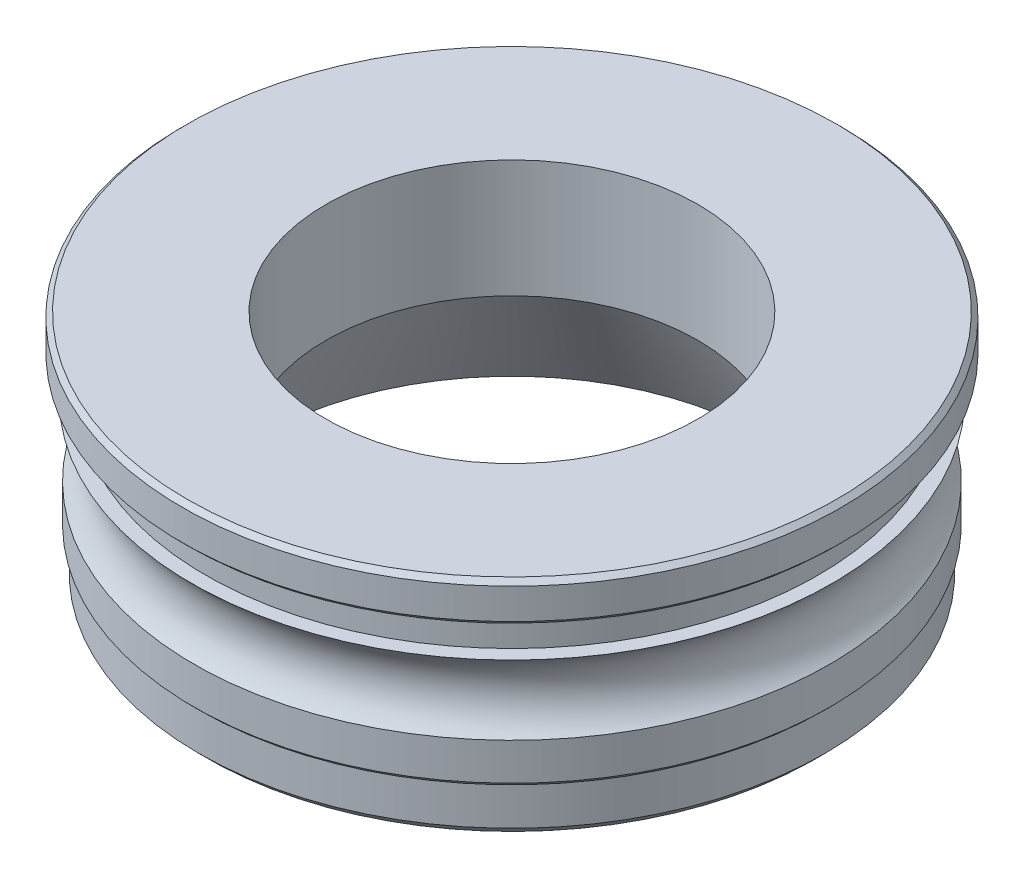
ISO-10303-21;
HEADER;
FILE_DESCRIPTION(('STEP AP214'),'2;1');
FILE_NAME('part.step','',(''),(''),'','','');
FILE_SCHEMA(('AUTOMOTIVE_DESIGN { 1 0 10303 214 1 1 1 1 }'));
ENDSEC;
DATA;
#1=APPLICATION_CONTEXT('core data for automotive mechanical design processes');
#2=APPLICATION_PROTOCOL_DEFINITION('international standard','automotive_design',2000,#1);
#3=PRODUCT_CONTEXT('',#1,'mechanical');
#4=PRODUCT('Part','Part','',(#3));
#5=PRODUCT_RELATED_PRODUCT_CATEGORY('part','',(#4));
#6=PRODUCT_DEFINITION_FORMATION('','',#4);
#7=PRODUCT_DEFINITION_CONTEXT('part definition',#1,'design');
#8=PRODUCT_DEFINITION('design','',#6,#7);
#9=PRODUCT_DEFINITION_SHAPE('','',#8);
#10=(LENGTH_UNIT() NAMED_UNIT(*) SI_UNIT(.MILLI.,.METRE.));
#11=(NAMED_UNIT(*) PLANE_ANGLE_UNIT() SI_UNIT($,.RADIAN.));
#12=(NAMED_UNIT(*) SI_UNIT($,.STERADIAN.) SOLID_ANGLE_UNIT());
#13=UNCERTAINTY_MEASURE_WITH_UNIT(LENGTH_MEASURE(1.E-05),#10,'distance_accuracy_value','');
#14=(GEOMETRIC_REPRESENTATION_CONTEXT(3) GLOBAL_UNCERTAINTY_ASSIGNED_CONTEXT((#13)) GLOBAL_UNIT_ASSIGNED_CONTEXT((#10,
#11,#12)) REPRESENTATION_CONTEXT('',''));
#15=CARTESIAN_POINT('',(0.,0.,0.));
#16=DIRECTION('',(0.,0.,1.));
#17=DIRECTION('',(1.,0.,0.));
#18=AXIS2_PLACEMENT_3D('',#15,#16,#17);
#19=CARTESIAN_POINT('',(5.39337567297407,0.,0.));
#20=DIRECTION('',(0.,-1.,0.));
#21=DIRECTION('',(0.,0.,-1.));
#22=AXIS2_PLACEMENT_3D('',#19,#20,#21);
#23=PLANE('',#22);
#24=CARTESIAN_POINT('',(0.,0.,0.));
#25=DIRECTION('',(0.,-1.,0.));
#26=DIRECTION('',(0.,0.,-1.));
#27=AXIS2_PLACEMENT_3D('',#24,#25,#26);
#28=CIRCLE('',#27,6.45);
#29=CARTESIAN_POINT('',(0.,0.,-6.45));
#30=VERTEX_POINT('',#29);
#31=EDGE_CURVE('E79',#30,#30,#28,.T.);
#32=ORIENTED_EDGE('',*,*,#31,.T.);
#33=EDGE_LOOP('',(#32));
#34=FACE_BOUND('',#33,.T.);
#35=CARTESIAN_POINT('',(0.,0.,0.));
#36=DIRECTION('',(0.,-1.,0.));
#37=DIRECTION('',(0.,0.,-1.));
#38=AXIS2_PLACEMENT_3D('',#35,#36,#37);
#39=CIRCLE('',#38,5.39337567297407);
#40=CARTESIAN_POINT('',(0.,0.,-5.39337567297407));
#41=VERTEX_POINT('',#40);
#42=EDGE_CURVE('E10',#41,#41,#39,.T.);
#43=ORIENTED_EDGE('',*,*,#42,.F.);
#44=EDGE_LOOP('',(#43));
#45=FACE_BOUND('',#44,.T.);
#46=ADVANCED_FACE('F30',(#34,#45),#23,.T.);
#47=CARTESIAN_POINT('',(0.,2.5,0.));
#48=DIRECTION('',(0.,-1.,0.));
#49=DIRECTION('',(0.,0.,-1.));
#50=AXIS2_PLACEMENT_3D('',#47,#48,#49);
#51=CONICAL_SURFACE('',#50,3.95,0.523598775598301);
#52=ORIENTED_EDGE('',*,*,#42,.T.);
#53=EDGE_LOOP('',(#52));
#54=FACE_BOUND('',#53,.T.);
#55=CARTESIAN_POINT('',(0.,2.5,0.));
#56=DIRECTION('',(0.,-1.,0.));
#57=DIRECTION('',(0.,0.,-1.));
#58=AXIS2_PLACEMENT_3D('',#55,#56,#57);
#59=CIRCLE('',#58,3.95);
#60=CARTESIAN_POINT('',(0.,2.5,-3.95));
#61=VERTEX_POINT('',#60);
#62=EDGE_CURVE('E36',#61,#61,#59,.T.);
#63=ORIENTED_EDGE('',*,*,#62,.F.);
#64=EDGE_LOOP('',(#63));
#65=FACE_BOUND('',#64,.T.);
#66=ADVANCED_FACE('F97',(#54,#65),#51,.F.);
#67=CARTESIAN_POINT('',(0.,0.,0.));
#68=DIRECTION('',(0.,-1.,0.));
#69=DIRECTION('',(0.,0.,-1.));
#70=AXIS2_PLACEMENT_3D('',#67,#68,#69);
#71=CYLINDRICAL_SURFACE('',#70,3.95);
#72=ORIENTED_EDGE('',*,*,#62,.T.);
#73=EDGE_LOOP('',(#72));
#74=FACE_BOUND('',#73,.T.);
#75=CARTESIAN_POINT('',(0.,5.,0.));
#76=DIRECTION('',(0.,-1.,0.));
#77=DIRECTION('',(0.,0.,-1.));
#78=AXIS2_PLACEMENT_3D('',#75,#76,#77);
#79=CIRCLE('',#78,3.95);
#80=CARTESIAN_POINT('',(0.,5.,-3.95));
#81=VERTEX_POINT('',#80);
#82=EDGE_CURVE('E40',#81,#81,#79,.T.);
#83=ORIENTED_EDGE('',*,*,#82,.F.);
#84=EDGE_LOOP('',(#83));
#85=FACE_BOUND('',#84,.T.);
#86=ADVANCED_FACE('F101',(#74,#85),#71,.F.);
#87=CARTESIAN_POINT('',(3.95,5.,0.));
#88=DIRECTION('',(0.,1.,0.));
#89=DIRECTION('',(0.,0.,1.));
#90=AXIS2_PLACEMENT_3D('',#87,#88,#89);
#91=PLANE('',#90);
#92=ORIENTED_EDGE('',*,*,#82,.T.);
#93=EDGE_LOOP('',(#92));
#94=FACE_BOUND('',#93,.T.);
#95=CARTESIAN_POINT('',(0.,5.,0.));
#96=DIRECTION('',(0.,-1.,0.));
#97=DIRECTION('',(0.,0.,-1.));
#98=AXIS2_PLACEMENT_3D('',#95,#96,#97);
#99=CIRCLE('',#98,6.9);
#100=CARTESIAN_POINT('',(0.,5.,-6.9));
#101=VERTEX_POINT('',#100);
#102=EDGE_CURVE('E44',#101,#101,#99,.T.);
#103=ORIENTED_EDGE('',*,*,#102,.F.);
#104=EDGE_LOOP('',(#103));
#105=FACE_BOUND('',#104,.T.);
#106=ADVANCED_FACE('F105',(#94,#105),#91,.T.);
#107=CARTESIAN_POINT('',(0.,4.9,0.));
#108=DIRECTION('',(0.,-1.,0.));
#109=DIRECTION('',(0.,0.,-1.));
#110=AXIS2_PLACEMENT_3D('',#107,#108,#109);
#111=CONICAL_SURFACE('',#110,7.,0.785398163397448);
#112=ORIENTED_EDGE('',*,*,#102,.T.);
#113=EDGE_LOOP('',(#112));
#114=FACE_BOUND('',#113,.T.);
#115=CARTESIAN_POINT('',(0.,4.9,0.));
#116=DIRECTION('',(0.,-1.,0.));
#117=DIRECTION('',(0.,0.,-1.));
#118=AXIS2_PLACEMENT_3D('',#115,#116,#117);
#119=CIRCLE('',#118,7.);
#120=CARTESIAN_POINT('',(0.,4.9,-7.));
#121=VERTEX_POINT('',#120);
#122=EDGE_CURVE('E49',#121,#121,#119,.T.);
#123=ORIENTED_EDGE('',*,*,#122,.F.);
#124=EDGE_LOOP('',(#123));
#125=FACE_BOUND('',#124,.T.);
#126=ADVANCED_FACE('F111',(#114,#125),#111,.T.);
#127=CARTESIAN_POINT('',(0.,0.,0.));
#128=DIRECTION('',(0.,-1.,0.));
#129=DIRECTION('',(0.,0.,-1.));
#130=AXIS2_PLACEMENT_3D('',#127,#128,#129);
#131=CYLINDRICAL_SURFACE('',#130,7.);
#132=ORIENTED_EDGE('',*,*,#122,.T.);
#133=EDGE_LOOP('',(#132));
#134=FACE_BOUND('',#133,.T.);
#135=CARTESIAN_POINT('',(0.,4.25,0.));
#136=DIRECTION('',(0.,-1.,0.));
#137=DIRECTION('',(0.,0.,-1.));
#138=AXIS2_PLACEMENT_3D('',#135,#136,#137);
#139=CIRCLE('',#138,7.);
#140=CARTESIAN_POINT('',(0.,4.25,-7.));
#141=VERTEX_POINT('',#140);
#142=EDGE_CURVE('E52',#141,#141,#139,.T.);
#143=ORIENTED_EDGE('',*,*,#142,.F.);
#144=EDGE_LOOP('',(#143));
#145=FACE_BOUND('',#144,.T.);
#146=ADVANCED_FACE('F115',(#134,#145),#131,.T.);
#147=CARTESIAN_POINT('',(0.,4.15,0.));
#148=DIRECTION('',(0.,1.,0.));
#149=DIRECTION('',(0.,0.,1.));
#150=AXIS2_PLACEMENT_3D('',#147,#148,#149);
#151=CONICAL_SURFACE('',#150,6.9,0.785398163397448);
#152=ORIENTED_EDGE('',*,*,#142,.T.);
#153=EDGE_LOOP('',(#152));
#154=FACE_BOUND('',#153,.T.);
#155=CARTESIAN_POINT('',(0.,4.15,0.));
#156=DIRECTION('',(0.,-1.,0.));
#157=DIRECTION('',(0.,0.,-1.));
#158=AXIS2_PLACEMENT_3D('',#155,#156,#157);
#159=CIRCLE('',#158,6.9);
#160=CARTESIAN_POINT('',(0.,4.15,-6.9));
#161=VERTEX_POINT('',#160);
#162=EDGE_CURVE('E55',#161,#161,#159,.T.);
#163=ORIENTED_EDGE('',*,*,#162,.F.);
#164=EDGE_LOOP('',(#163));
#165=FACE_BOUND('',#164,.T.);
#166=ADVANCED_FACE('F119',(#154,#165),#151,.T.);
#167=CARTESIAN_POINT('',(6.9,4.15,0.));
#168=DIRECTION('',(0.,-1.,0.));
#169=DIRECTION('',(0.,0.,-1.));
#170=AXIS2_PLACEMENT_3D('',#167,#168,#169);
#171=PLANE('',#170);
#172=ORIENTED_EDGE('',*,*,#162,.T.);
#173=EDGE_LOOP('',(#172));
#174=FACE_BOUND('',#173,.T.);
#175=CARTESIAN_POINT('',(0.,4.15,0.));
#176=DIRECTION('',(0.,-1.,0.));
#177=DIRECTION('',(0.,0.,-1.));
#178=AXIS2_PLACEMENT_3D('',#175,#176,#177);
#179=CIRCLE('',#178,6.5);
#180=CARTESIAN_POINT('',(0.,4.15,-6.5));
#181=VERTEX_POINT('',#180);
#182=EDGE_CURVE('E58',#181,#181,#179,.T.);
#183=ORIENTED_EDGE('',*,*,#182,.F.);
#184=EDGE_LOOP('',(#183));
#185=FACE_BOUND('',#184,.T.);
#186=ADVANCED_FACE('F123',(#174,#185),#171,.T.);
#187=CARTESIAN_POINT('',(0.,0.,0.));
#188=DIRECTION('',(0.,-1.,0.));
#189=DIRECTION('',(0.,0.,-1.));
#190=AXIS2_PLACEMENT_3D('',#187,#188,#189);
#191=CYLINDRICAL_SURFACE('',#190,6.5);
#192=ORIENTED_EDGE('',*,*,#182,.T.);
#193=EDGE_LOOP('',(#192));
#194=FACE_BOUND('',#193,.T.);
#195=CARTESIAN_POINT('',(0.,3.4,0.));
#196=DIRECTION('',(0.,-1.,0.));
#197=DIRECTION('',(0.,0.,-1.));
#198=AXIS2_PLACEMENT_3D('',#195,#196,#197);
#199=CIRCLE('',#198,6.5);
#200=CARTESIAN_POINT('',(0.,3.4,-6.5));
#201=VERTEX_POINT('',#200);
#202=EDGE_CURVE('E61',#201,#201,#199,.T.);
#203=ORIENTED_EDGE('',*,*,#202,.F.);
#204=EDGE_LOOP('',(#203));
#205=FACE_BOUND('',#204,.T.);
#206=ADVANCED_FACE('F127',(#194,#205),#191,.T.);
#207=CARTESIAN_POINT('',(6.5,3.4,0.));
#208=DIRECTION('',(0.,1.,0.));
#209=DIRECTION('',(0.,0.,1.));
#210=AXIS2_PLACEMENT_3D('',#207,#208,#209);
#211=PLANE('',#210);
#212=ORIENTED_EDGE('',*,*,#202,.T.);
#213=EDGE_LOOP('',(#212));
#214=FACE_BOUND('',#213,.T.);
#215=CARTESIAN_POINT('',(0.,3.4,0.));
#216=DIRECTION('',(0.,-1.,0.));
#217=DIRECTION('',(0.,0.,-1.));
#218=AXIS2_PLACEMENT_3D('',#215,#216,#217);
#219=CIRCLE('',#218,6.8);
#220=CARTESIAN_POINT('',(0.,3.4,-6.8));
#221=VERTEX_POINT('',#220);
#222=EDGE_CURVE('E64',#221,#221,#219,.T.);
#223=ORIENTED_EDGE('',*,*,#222,.F.);
#224=EDGE_LOOP('',(#223));
#225=FACE_BOUND('',#224,.T.);
#226=ADVANCED_FACE('F131',(#214,#225),#211,.T.);
#227=CARTESIAN_POINT('',(0.,2.62284833400189,0.));
#228=DIRECTION('',(0.,-1.,0.));
#229=DIRECTION('',(0.,0.,-1.));
#230=AXIS2_PLACEMENT_3D('',#227,#228,#229);
#231=TOROIDAL_SURFACE('',#230,7.42931334646292,1.);
#232=ORIENTED_EDGE('',*,*,#222,.T.);
#233=EDGE_LOOP('',(#232));
#234=FACE_BOUND('',#233,.T.);
#235=CARTESIAN_POINT('',(0.,1.889,0.));
#236=DIRECTION('',(0.,-1.,0.));
#237=DIRECTION('',(0.,0.,-1.));
#238=AXIS2_PLACEMENT_3D('',#235,#236,#237);
#239=CIRCLE('',#238,6.75);
#240=CARTESIAN_POINT('',(0.,1.889,-6.75));
#241=VERTEX_POINT('',#240);
#242=EDGE_CURVE('E67',#241,#241,#239,.T.);
#243=ORIENTED_EDGE('',*,*,#242,.F.);
#244=EDGE_LOOP('',(#243));
#245=FACE_BOUND('',#244,.T.);
#246=ADVANCED_FACE('F135',(#234,#245),#231,.F.);
#247=CARTESIAN_POINT('',(0.,0.,0.));
#248=DIRECTION('',(0.,-1.,0.));
#249=DIRECTION('',(0.,0.,-1.));
#250=AXIS2_PLACEMENT_3D('',#247,#248,#249);
#251=CYLINDRICAL_SURFACE('',#250,6.75);
#252=ORIENTED_EDGE('',*,*,#242,.T.);
#253=EDGE_LOOP('',(#252));
#254=FACE_BOUND('',#253,.T.);
#255=CARTESIAN_POINT('',(0.,1.1,0.));
#256=DIRECTION('',(0.,-1.,0.));
#257=DIRECTION('',(0.,0.,-1.));
#258=AXIS2_PLACEMENT_3D('',#255,#256,#257);
#259=CIRCLE('',#258,6.75);
#260=CARTESIAN_POINT('',(0.,1.1,-6.75));
#261=VERTEX_POINT('',#260);
#262=EDGE_CURVE('E70',#261,#261,#259,.T.);
#263=ORIENTED_EDGE('',*,*,#262,.F.);
#264=EDGE_LOOP('',(#263));
#265=FACE_BOUND('',#264,.T.);
#266=ADVANCED_FACE('F139',(#254,#265),#251,.T.);
#267=CARTESIAN_POINT('',(0.,1.,0.));
#268=DIRECTION('',(0.,1.,0.));
#269=DIRECTION('',(0.,0.,1.));
#270=AXIS2_PLACEMENT_3D('',#267,#268,#269);
#271=CONICAL_SURFACE('',#270,6.65,0.785398163397441);
#272=ORIENTED_EDGE('',*,*,#262,.T.);
#273=EDGE_LOOP('',(#272));
#274=FACE_BOUND('',#273,.T.);
#275=CARTESIAN_POINT('',(0.,1.,0.));
#276=DIRECTION('',(0.,-1.,0.));
#277=DIRECTION('',(0.,0.,-1.));
#278=AXIS2_PLACEMENT_3D('',#275,#276,#277);
#279=CIRCLE('',#278,6.65);
#280=CARTESIAN_POINT('',(0.,1.,-6.65));
#281=VERTEX_POINT('',#280);
#282=EDGE_CURVE('E73',#281,#281,#279,.T.);
#283=ORIENTED_EDGE('',*,*,#282,.F.);
#284=EDGE_LOOP('',(#283));
#285=FACE_BOUND('',#284,.T.);
#286=ADVANCED_FACE('F93',(#274,#285),#271,.T.);
#287=CARTESIAN_POINT('',(0.,0.,0.));
#288=DIRECTION('',(0.,-1.,0.));
#289=DIRECTION('',(0.,0.,-1.));
#290=AXIS2_PLACEMENT_3D('',#287,#288,#289);
#291=CYLINDRICAL_SURFACE('',#290,6.65);
#292=ORIENTED_EDGE('',*,*,#282,.T.);
#293=EDGE_LOOP('',(#292));
#294=FACE_BOUND('',#293,.T.);
#295=CARTESIAN_POINT('',(0.,0.2,0.));
#296=DIRECTION('',(0.,-1.,0.));
#297=DIRECTION('',(0.,0.,-1.));
#298=AXIS2_PLACEMENT_3D('',#295,#296,#297);
#299=CIRCLE('',#298,6.65);
#300=CARTESIAN_POINT('',(0.,0.2,-6.65));
#301=VERTEX_POINT('',#300);
#302=EDGE_CURVE('E76',#301,#301,#299,.T.);
#303=ORIENTED_EDGE('',*,*,#302,.F.);
#304=EDGE_LOOP('',(#303));
#305=FACE_BOUND('',#304,.T.);
#306=ADVANCED_FACE('F87',(#294,#305),#291,.T.);
#307=CARTESIAN_POINT('',(0.,0.,0.));
#308=DIRECTION('',(0.,1.,0.));
#309=DIRECTION('',(0.,0.,1.));
#310=AXIS2_PLACEMENT_3D('',#307,#308,#309);
#311=CONICAL_SURFACE('',#310,6.45,0.785398163397443);
#312=ORIENTED_EDGE('',*,*,#302,.T.);
#313=EDGE_LOOP('',(#312));
#314=FACE_BOUND('',#313,.T.);
#315=ORIENTED_EDGE('',*,*,#31,.F.);
#316=EDGE_LOOP('',(#315));
#317=FACE_BOUND('',#316,.T.);
#318=ADVANCED_FACE('F85',(#314,#317),#311,.T.);
#319=CLOSED_SHELL('',(#46,#66,#86,#106,#126,#146,#166,#186,#206,#226,#246,#266,#286,#306,#318));
#320=MANIFOLD_SOLID_BREP('B2',#319);
#321=ADVANCED_BREP_SHAPE_REPRESENTATION('',(#18,#320),#14);
#322=SHAPE_DEFINITION_REPRESENTATION(#9,#321);
ENDSEC;
END-ISO-10303-21;
